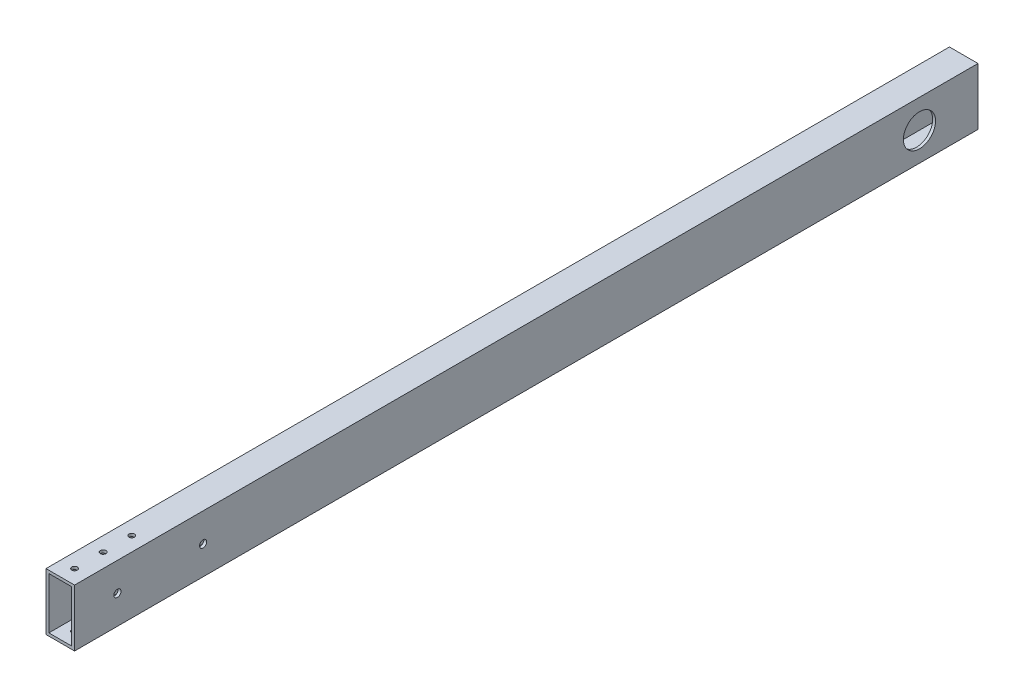
ISO-10303-21;
HEADER;
FILE_DESCRIPTION(('STEP AP214'),'2;1');
FILE_NAME('part.step','',(''),(''),'','','');
FILE_SCHEMA(('AUTOMOTIVE_DESIGN { 1 0 10303 214 1 1 1 1 }'));
ENDSEC;
DATA;
#1=APPLICATION_CONTEXT('core data for automotive mechanical design processes');
#2=APPLICATION_PROTOCOL_DEFINITION('international standard','automotive_design',2000,#1);
#3=PRODUCT_CONTEXT('',#1,'mechanical');
#4=PRODUCT('Part','Part','',(#3));
#5=PRODUCT_RELATED_PRODUCT_CATEGORY('part','',(#4));
#6=PRODUCT_DEFINITION_FORMATION('','',#4);
#7=PRODUCT_DEFINITION_CONTEXT('part definition',#1,'design');
#8=PRODUCT_DEFINITION('design','',#6,#7);
#9=PRODUCT_DEFINITION_SHAPE('','',#8);
#10=(LENGTH_UNIT() NAMED_UNIT(*) SI_UNIT(.MILLI.,.METRE.));
#11=(NAMED_UNIT(*) PLANE_ANGLE_UNIT() SI_UNIT($,.RADIAN.));
#12=(NAMED_UNIT(*) SI_UNIT($,.STERADIAN.) SOLID_ANGLE_UNIT());
#13=UNCERTAINTY_MEASURE_WITH_UNIT(LENGTH_MEASURE(1.E-05),#10,'distance_accuracy_value','');
#14=(GEOMETRIC_REPRESENTATION_CONTEXT(3) GLOBAL_UNCERTAINTY_ASSIGNED_CONTEXT((#13)) GLOBAL_UNIT_ASSIGNED_CONTEXT((#10,
#11,#12)) REPRESENTATION_CONTEXT('',''));
#15=CARTESIAN_POINT('',(0.,0.,0.));
#16=DIRECTION('',(0.,0.,1.));
#17=DIRECTION('',(1.,0.,0.));
#18=AXIS2_PLACEMENT_3D('',#15,#16,#17);
#19=CARTESIAN_POINT('',(0.,0.,401.6375));
#20=DIRECTION('',(0.,0.,1.));
#21=DIRECTION('',(1.,0.,0.));
#22=AXIS2_PLACEMENT_3D('',#19,#20,#21);
#23=PLANE('',#22);
#24=DIRECTION('',(0.,1.,0.));
#25=VECTOR('',#24,1.);
#26=CARTESIAN_POINT('',(12.7,-25.4,401.6375));
#27=LINE('',#26,#25);
#28=CARTESIAN_POINT('',(12.7,-25.4,401.6375));
#29=VERTEX_POINT('',#28);
#30=CARTESIAN_POINT('',(12.7,25.4,401.6375));
#31=VERTEX_POINT('',#30);
#32=EDGE_CURVE('E165',#29,#31,#27,.T.);
#33=ORIENTED_EDGE('',*,*,#32,.T.);
#34=DIRECTION('',(-1.,0.,0.));
#35=VECTOR('',#34,1.);
#36=CARTESIAN_POINT('',(-12.7,25.4,401.6375));
#37=LINE('',#36,#35);
#38=CARTESIAN_POINT('',(-12.7,25.4,401.6375));
#39=VERTEX_POINT('',#38);
#40=EDGE_CURVE('E168',#31,#39,#37,.T.);
#41=ORIENTED_EDGE('',*,*,#40,.T.);
#42=DIRECTION('',(0.,-1.,0.));
#43=VECTOR('',#42,1.);
#44=CARTESIAN_POINT('',(-12.7,-25.4,401.6375));
#45=LINE('',#44,#43);
#46=CARTESIAN_POINT('',(-12.7,-25.4,401.6375));
#47=VERTEX_POINT('',#46);
#48=EDGE_CURVE('E171',#39,#47,#45,.T.);
#49=ORIENTED_EDGE('',*,*,#48,.T.);
#50=DIRECTION('',(1.,0.,0.));
#51=VECTOR('',#50,1.);
#52=CARTESIAN_POINT('',(-12.7,-25.4,401.6375));
#53=LINE('',#52,#51);
#54=EDGE_CURVE('E173',#47,#29,#53,.T.);
#55=ORIENTED_EDGE('',*,*,#54,.T.);
#56=EDGE_LOOP('',(#33,#41,#49,#55));
#57=FACE_BOUND('',#56,.T.);
#58=DIRECTION('',(-1.,0.,0.));
#59=VECTOR('',#58,1.);
#60=CARTESIAN_POINT('',(0.,22.86,401.6375));
#61=LINE('',#60,#59);
#62=CARTESIAN_POINT('',(10.16,22.86,401.6375));
#63=VERTEX_POINT('',#62);
#64=CARTESIAN_POINT('',(-10.16,22.86,401.6375));
#65=VERTEX_POINT('',#64);
#66=EDGE_CURVE('E135',#63,#65,#61,.T.);
#67=ORIENTED_EDGE('',*,*,#66,.F.);
#68=DIRECTION('',(0.,1.,0.));
#69=VECTOR('',#68,1.);
#70=CARTESIAN_POINT('',(10.16,0.,401.6375));
#71=LINE('',#70,#69);
#72=CARTESIAN_POINT('',(10.16,-22.86,401.6375));
#73=VERTEX_POINT('',#72);
#74=EDGE_CURVE('E127',#73,#63,#71,.T.);
#75=ORIENTED_EDGE('',*,*,#74,.F.);
#76=DIRECTION('',(1.,0.,0.));
#77=VECTOR('',#76,1.);
#78=CARTESIAN_POINT('',(0.,-22.86,401.6375));
#79=LINE('',#78,#77);
#80=CARTESIAN_POINT('',(-10.16,-22.86,401.6375));
#81=VERTEX_POINT('',#80);
#82=EDGE_CURVE('E149',#81,#73,#79,.T.);
#83=ORIENTED_EDGE('',*,*,#82,.F.);
#84=DIRECTION('',(0.,-1.,0.));
#85=VECTOR('',#84,1.);
#86=CARTESIAN_POINT('',(-10.16,0.,401.6375));
#87=LINE('',#86,#85);
#88=EDGE_CURVE('E147',#65,#81,#87,.T.);
#89=ORIENTED_EDGE('',*,*,#88,.F.);
#90=EDGE_LOOP('',(#67,#75,#83,#89));
#91=FACE_BOUND('',#90,.T.);
#92=ADVANCED_FACE('F60',(#57,#91),#23,.T.);
#93=CARTESIAN_POINT('',(0.,0.,-401.6375));
#94=DIRECTION('',(0.,0.,1.));
#95=DIRECTION('',(1.,0.,0.));
#96=AXIS2_PLACEMENT_3D('',#93,#94,#95);
#97=PLANE('',#96);
#98=DIRECTION('',(0.,1.,0.));
#99=VECTOR('',#98,1.);
#100=CARTESIAN_POINT('',(12.7,-25.4,-401.6375));
#101=LINE('',#100,#99);
#102=CARTESIAN_POINT('',(12.7,-25.4,-401.6375));
#103=VERTEX_POINT('',#102);
#104=CARTESIAN_POINT('',(12.7,25.4,-401.6375));
#105=VERTEX_POINT('',#104);
#106=EDGE_CURVE('E143',#103,#105,#101,.T.);
#107=ORIENTED_EDGE('',*,*,#106,.F.);
#108=DIRECTION('',(1.,0.,0.));
#109=VECTOR('',#108,1.);
#110=CARTESIAN_POINT('',(-12.7,-25.4,-401.6375));
#111=LINE('',#110,#109);
#112=CARTESIAN_POINT('',(-12.7,-25.4,-401.6375));
#113=VERTEX_POINT('',#112);
#114=EDGE_CURVE('E169',#113,#103,#111,.T.);
#115=ORIENTED_EDGE('',*,*,#114,.F.);
#116=DIRECTION('',(0.,-1.,0.));
#117=VECTOR('',#116,1.);
#118=CARTESIAN_POINT('',(-12.7,-25.4,-401.6375));
#119=LINE('',#118,#117);
#120=CARTESIAN_POINT('',(-12.7,25.4,-401.6375));
#121=VERTEX_POINT('',#120);
#122=EDGE_CURVE('E180',#121,#113,#119,.T.);
#123=ORIENTED_EDGE('',*,*,#122,.F.);
#124=DIRECTION('',(-1.,0.,0.));
#125=VECTOR('',#124,1.);
#126=CARTESIAN_POINT('',(-12.7,25.4,-401.6375));
#127=LINE('',#126,#125);
#128=EDGE_CURVE('E178',#105,#121,#127,.T.);
#129=ORIENTED_EDGE('',*,*,#128,.F.);
#130=EDGE_LOOP('',(#107,#115,#123,#129));
#131=FACE_BOUND('',#130,.T.);
#132=DIRECTION('',(0.,1.,0.));
#133=VECTOR('',#132,1.);
#134=CARTESIAN_POINT('',(10.16,0.,-401.6375));
#135=LINE('',#134,#133);
#136=CARTESIAN_POINT('',(10.16,-22.86,-401.6375));
#137=VERTEX_POINT('',#136);
#138=CARTESIAN_POINT('',(10.16,22.86,-401.6375));
#139=VERTEX_POINT('',#138);
#140=EDGE_CURVE('E85',#137,#139,#135,.T.);
#141=ORIENTED_EDGE('',*,*,#140,.T.);
#142=DIRECTION('',(-1.,0.,0.));
#143=VECTOR('',#142,1.);
#144=CARTESIAN_POINT('',(0.,22.86,-401.6375));
#145=LINE('',#144,#143);
#146=CARTESIAN_POINT('',(-10.16,22.86,-401.6375));
#147=VERTEX_POINT('',#146);
#148=EDGE_CURVE('E142',#139,#147,#145,.T.);
#149=ORIENTED_EDGE('',*,*,#148,.T.);
#150=DIRECTION('',(0.,-1.,0.));
#151=VECTOR('',#150,1.);
#152=CARTESIAN_POINT('',(-10.16,0.,-401.6375));
#153=LINE('',#152,#151);
#154=CARTESIAN_POINT('',(-10.16,-22.86,-401.6375));
#155=VERTEX_POINT('',#154);
#156=EDGE_CURVE('E157',#147,#155,#153,.T.);
#157=ORIENTED_EDGE('',*,*,#156,.T.);
#158=DIRECTION('',(1.,0.,0.));
#159=VECTOR('',#158,1.);
#160=CARTESIAN_POINT('',(0.,-22.86,-401.6375));
#161=LINE('',#160,#159);
#162=EDGE_CURVE('E136',#155,#137,#161,.T.);
#163=ORIENTED_EDGE('',*,*,#162,.T.);
#164=EDGE_LOOP('',(#141,#149,#157,#163));
#165=FACE_BOUND('',#164,.T.);
#166=ADVANCED_FACE('F307',(#131,#165),#97,.F.);
#167=CARTESIAN_POINT('',(12.7,-25.4,401.6375));
#168=DIRECTION('',(-1.,0.,0.));
#169=DIRECTION('',(0.,0.,1.));
#170=AXIS2_PLACEMENT_3D('',#167,#168,#169);
#171=PLANE('',#170);
#172=CARTESIAN_POINT('',(12.7,0.,363.5375));
#173=DIRECTION('',(-1.,0.,0.));
#174=DIRECTION('',(0.,0.,1.));
#175=AXIS2_PLACEMENT_3D('',#172,#173,#174);
#176=CIRCLE('',#175,3.17499999999997);
#177=CARTESIAN_POINT('',(12.7,0.,366.7125));
#178=VERTEX_POINT('',#177);
#179=EDGE_CURVE('E198',#178,#178,#176,.T.);
#180=ORIENTED_EDGE('',*,*,#179,.T.);
#181=EDGE_LOOP('',(#180));
#182=FACE_BOUND('',#181,.T.);
#183=CARTESIAN_POINT('',(12.7,0.,287.3375));
#184=DIRECTION('',(-1.,0.,0.));
#185=DIRECTION('',(0.,0.,1.));
#186=AXIS2_PLACEMENT_3D('',#183,#184,#185);
#187=CIRCLE('',#186,3.17499999999997);
#188=CARTESIAN_POINT('',(12.7,0.,290.5125));
#189=VERTEX_POINT('',#188);
#190=EDGE_CURVE('E270',#189,#189,#187,.T.);
#191=ORIENTED_EDGE('',*,*,#190,.T.);
#192=EDGE_LOOP('',(#191));
#193=FACE_BOUND('',#192,.T.);
#194=CARTESIAN_POINT('',(12.7,0.,-349.594816949944));
#195=DIRECTION('',(-1.,0.,0.));
#196=DIRECTION('',(0.,0.,1.));
#197=AXIS2_PLACEMENT_3D('',#194,#195,#196);
#198=CIRCLE('',#197,14.2875);
#199=CARTESIAN_POINT('',(12.7,0.,-335.307316949944));
#200=VERTEX_POINT('',#199);
#201=EDGE_CURVE('E193',#200,#200,#198,.T.);
#202=ORIENTED_EDGE('',*,*,#201,.T.);
#203=EDGE_LOOP('',(#202));
#204=FACE_BOUND('',#203,.T.);
#205=ORIENTED_EDGE('',*,*,#106,.T.);
#206=DIRECTION('',(0.,0.,-1.));
#207=VECTOR('',#206,1.);
#208=CARTESIAN_POINT('',(12.7,25.4,401.6375));
#209=LINE('',#208,#207);
#210=EDGE_CURVE('E12',#31,#105,#209,.T.);
#211=ORIENTED_EDGE('',*,*,#210,.F.);
#212=ORIENTED_EDGE('',*,*,#32,.F.);
#213=DIRECTION('',(0.,0.,-1.));
#214=VECTOR('',#213,1.);
#215=CARTESIAN_POINT('',(12.7,-25.4,401.6375));
#216=LINE('',#215,#214);
#217=EDGE_CURVE('E175',#29,#103,#216,.T.);
#218=ORIENTED_EDGE('',*,*,#217,.T.);
#219=EDGE_LOOP('',(#205,#211,#212,#218));
#220=FACE_BOUND('',#219,.T.);
#221=ADVANCED_FACE('F62',(#182,#193,#204,#220),#171,.F.);
#222=CARTESIAN_POINT('',(-12.7,25.4,401.6375));
#223=DIRECTION('',(0.,-1.,0.));
#224=DIRECTION('',(0.,0.,-1.));
#225=AXIS2_PLACEMENT_3D('',#222,#223,#224);
#226=PLANE('',#225);
#227=CARTESIAN_POINT('',(0.,25.4,338.1375));
#228=DIRECTION('',(0.,1.,0.));
#229=DIRECTION('',(0.,0.,1.));
#230=AXIS2_PLACEMENT_3D('',#227,#228,#229);
#231=CIRCLE('',#230,2.47650000000006);
#232=CARTESIAN_POINT('',(0.,25.4,340.614));
#233=VERTEX_POINT('',#232);
#234=EDGE_CURVE('E240',#233,#233,#231,.T.);
#235=ORIENTED_EDGE('',*,*,#234,.F.);
#236=EDGE_LOOP('',(#235));
#237=FACE_BOUND('',#236,.T.);
#238=CARTESIAN_POINT('',(0.,25.4,363.5375));
#239=DIRECTION('',(0.,1.,0.));
#240=DIRECTION('',(0.,0.,1.));
#241=AXIS2_PLACEMENT_3D('',#238,#239,#240);
#242=CIRCLE('',#241,2.4765);
#243=CARTESIAN_POINT('',(0.,25.4,366.014));
#244=VERTEX_POINT('',#243);
#245=EDGE_CURVE('E246',#244,#244,#242,.T.);
#246=ORIENTED_EDGE('',*,*,#245,.F.);
#247=EDGE_LOOP('',(#246));
#248=FACE_BOUND('',#247,.T.);
#249=CARTESIAN_POINT('',(0.,25.4,388.9375));
#250=DIRECTION('',(0.,1.,0.));
#251=DIRECTION('',(0.,0.,1.));
#252=AXIS2_PLACEMENT_3D('',#249,#250,#251);
#253=CIRCLE('',#252,2.47649999999997);
#254=CARTESIAN_POINT('',(0.,25.4,391.414));
#255=VERTEX_POINT('',#254);
#256=EDGE_CURVE('E229',#255,#255,#253,.T.);
#257=ORIENTED_EDGE('',*,*,#256,.F.);
#258=EDGE_LOOP('',(#257));
#259=FACE_BOUND('',#258,.T.);
#260=ORIENTED_EDGE('',*,*,#128,.T.);
#261=DIRECTION('',(0.,0.,-1.));
#262=VECTOR('',#261,1.);
#263=CARTESIAN_POINT('',(-12.7,25.4,401.6375));
#264=LINE('',#263,#262);
#265=EDGE_CURVE('E69',#39,#121,#264,.T.);
#266=ORIENTED_EDGE('',*,*,#265,.F.);
#267=ORIENTED_EDGE('',*,*,#40,.F.);
#268=ORIENTED_EDGE('',*,*,#210,.T.);
#269=EDGE_LOOP('',(#260,#266,#267,#268));
#270=FACE_BOUND('',#269,.T.);
#271=ADVANCED_FACE('F316',(#237,#248,#259,#270),#226,.F.);
#272=CARTESIAN_POINT('',(-12.7,-25.4,401.6375));
#273=DIRECTION('',(1.,0.,0.));
#274=DIRECTION('',(0.,0.,-1.));
#275=AXIS2_PLACEMENT_3D('',#272,#273,#274);
#276=PLANE('',#275);
#277=CARTESIAN_POINT('',(-12.7,0.,363.5375));
#278=DIRECTION('',(-1.,0.,0.));
#279=DIRECTION('',(0.,0.,1.));
#280=AXIS2_PLACEMENT_3D('',#277,#278,#279);
#281=CIRCLE('',#280,3.17499999999997);
#282=CARTESIAN_POINT('',(-12.7,0.,366.7125));
#283=VERTEX_POINT('',#282);
#284=EDGE_CURVE('E267',#283,#283,#281,.T.);
#285=ORIENTED_EDGE('',*,*,#284,.F.);
#286=EDGE_LOOP('',(#285));
#287=FACE_BOUND('',#286,.T.);
#288=CARTESIAN_POINT('',(-12.7,0.,287.3375));
#289=DIRECTION('',(-1.,0.,0.));
#290=DIRECTION('',(0.,0.,1.));
#291=AXIS2_PLACEMENT_3D('',#288,#289,#290);
#292=CIRCLE('',#291,3.17499999999997);
#293=CARTESIAN_POINT('',(-12.7,0.,290.5125));
#294=VERTEX_POINT('',#293);
#295=EDGE_CURVE('E210',#294,#294,#292,.T.);
#296=ORIENTED_EDGE('',*,*,#295,.F.);
#297=EDGE_LOOP('',(#296));
#298=FACE_BOUND('',#297,.T.);
#299=CARTESIAN_POINT('',(-12.7,0.,-349.594816949944));
#300=DIRECTION('',(-1.,0.,0.));
#301=DIRECTION('',(0.,0.,1.));
#302=AXIS2_PLACEMENT_3D('',#299,#300,#301);
#303=CIRCLE('',#302,14.2875);
#304=CARTESIAN_POINT('',(-12.7,0.,-335.307316949944));
#305=VERTEX_POINT('',#304);
#306=EDGE_CURVE('E279',#305,#305,#303,.T.);
#307=ORIENTED_EDGE('',*,*,#306,.F.);
#308=EDGE_LOOP('',(#307));
#309=FACE_BOUND('',#308,.T.);
#310=ORIENTED_EDGE('',*,*,#122,.T.);
#311=DIRECTION('',(0.,0.,-1.));
#312=VECTOR('',#311,1.);
#313=CARTESIAN_POINT('',(-12.7,-25.4,401.6375));
#314=LINE('',#313,#312);
#315=EDGE_CURVE('E185',#47,#113,#314,.T.);
#316=ORIENTED_EDGE('',*,*,#315,.F.);
#317=ORIENTED_EDGE('',*,*,#48,.F.);
#318=ORIENTED_EDGE('',*,*,#265,.T.);
#319=EDGE_LOOP('',(#310,#316,#317,#318));
#320=FACE_BOUND('',#319,.T.);
#321=ADVANCED_FACE('F300',(#287,#298,#309,#320),#276,.F.);
#322=CARTESIAN_POINT('',(-12.7,-25.4,401.6375));
#323=DIRECTION('',(0.,1.,0.));
#324=DIRECTION('',(0.,0.,1.));
#325=AXIS2_PLACEMENT_3D('',#322,#323,#324);
#326=PLANE('',#325);
#327=CARTESIAN_POINT('',(-5.00130603698018,-25.4,-196.811900000001));
#328=DIRECTION('',(0.,-1.,0.));
#329=DIRECTION('',(0.,0.,-1.));
#330=AXIS2_PLACEMENT_3D('',#327,#328,#329);
#331=CIRCLE('',#330,2.47650423254111);
#332=CARTESIAN_POINT('',(-5.00130603698018,-25.4,-199.288404232542));
#333=VERTEX_POINT('',#332);
#334=EDGE_CURVE('E225',#333,#333,#331,.T.);
#335=ORIENTED_EDGE('',*,*,#334,.F.);
#336=EDGE_LOOP('',(#335));
#337=FACE_BOUND('',#336,.T.);
#338=CARTESIAN_POINT('',(-5.04826627900002,-25.4,-184.111986821431));
#339=DIRECTION('',(0.,-1.,0.));
#340=DIRECTION('',(0.,0.,-1.));
#341=AXIS2_PLACEMENT_3D('',#338,#339,#340);
#342=CIRCLE('',#341,2.47650423254111);
#343=CARTESIAN_POINT('',(-5.04826627900002,-25.4,-186.588491053972));
#344=VERTEX_POINT('',#343);
#345=EDGE_CURVE('E231',#344,#344,#342,.T.);
#346=ORIENTED_EDGE('',*,*,#345,.F.);
#347=EDGE_LOOP('',(#346));
#348=FACE_BOUND('',#347,.T.);
#349=CARTESIAN_POINT('',(0.,-25.4,338.1375));
#350=DIRECTION('',(0.,1.,0.));
#351=DIRECTION('',(0.,0.,1.));
#352=AXIS2_PLACEMENT_3D('',#349,#350,#351);
#353=CIRCLE('',#352,2.47650000000006);
#354=CARTESIAN_POINT('',(0.,-25.4,340.614));
#355=VERTEX_POINT('',#354);
#356=EDGE_CURVE('E215',#355,#355,#353,.T.);
#357=ORIENTED_EDGE('',*,*,#356,.T.);
#358=EDGE_LOOP('',(#357));
#359=FACE_BOUND('',#358,.T.);
#360=CARTESIAN_POINT('',(0.,-25.4,363.5375));
#361=DIRECTION('',(0.,1.,0.));
#362=DIRECTION('',(0.,0.,1.));
#363=AXIS2_PLACEMENT_3D('',#360,#361,#362);
#364=CIRCLE('',#363,2.4765);
#365=CARTESIAN_POINT('',(0.,-25.4,366.014));
#366=VERTEX_POINT('',#365);
#367=EDGE_CURVE('E243',#366,#366,#364,.T.);
#368=ORIENTED_EDGE('',*,*,#367,.T.);
#369=EDGE_LOOP('',(#368));
#370=FACE_BOUND('',#369,.T.);
#371=CARTESIAN_POINT('',(0.,-25.4,388.9375));
#372=DIRECTION('',(0.,1.,0.));
#373=DIRECTION('',(0.,0.,1.));
#374=AXIS2_PLACEMENT_3D('',#371,#372,#373);
#375=CIRCLE('',#374,2.47649999999997);
#376=CARTESIAN_POINT('',(0.,-25.4,391.414));
#377=VERTEX_POINT('',#376);
#378=EDGE_CURVE('E249',#377,#377,#375,.T.);
#379=ORIENTED_EDGE('',*,*,#378,.T.);
#380=EDGE_LOOP('',(#379));
#381=FACE_BOUND('',#380,.T.);
#382=CARTESIAN_POINT('',(-5.10954657230445E-06,-25.4,228.865824925079));
#383=DIRECTION('',(0.,-1.,0.));
#384=DIRECTION('',(0.,0.,-1.));
#385=AXIS2_PLACEMENT_3D('',#382,#383,#384);
#386=CIRCLE('',#385,2.47650000000002);
#387=CARTESIAN_POINT('',(-5.10954657230445E-06,-25.4,226.389324925079));
#388=VERTEX_POINT('',#387);
#389=EDGE_CURVE('E207',#388,#388,#386,.T.);
#390=ORIENTED_EDGE('',*,*,#389,.F.);
#391=EDGE_LOOP('',(#390));
#392=FACE_BOUND('',#391,.T.);
#393=CARTESIAN_POINT('',(2.1163626406917E-13,-25.4,152.665824925079));
#394=DIRECTION('',(0.,-1.,0.));
#395=DIRECTION('',(0.,0.,-1.));
#396=AXIS2_PLACEMENT_3D('',#393,#394,#395);
#397=CIRCLE('',#396,2.47650000000001);
#398=CARTESIAN_POINT('',(2.1163626406917E-13,-25.4,150.189324925079));
#399=VERTEX_POINT('',#398);
#400=EDGE_CURVE('E260',#399,#399,#397,.T.);
#401=ORIENTED_EDGE('',*,*,#400,.F.);
#402=EDGE_LOOP('',(#401));
#403=FACE_BOUND('',#402,.T.);
#404=ORIENTED_EDGE('',*,*,#114,.T.);
#405=ORIENTED_EDGE('',*,*,#217,.F.);
#406=ORIENTED_EDGE('',*,*,#54,.F.);
#407=ORIENTED_EDGE('',*,*,#315,.T.);
#408=EDGE_LOOP('',(#404,#405,#406,#407));
#409=FACE_BOUND('',#408,.T.);
#410=ADVANCED_FACE('F290',(#337,#348,#359,#370,#381,#392,#403,#409),#326,.F.);
#411=CARTESIAN_POINT('',(10.16,0.,401.6375));
#412=DIRECTION('',(-1.,0.,0.));
#413=DIRECTION('',(0.,0.,1.));
#414=AXIS2_PLACEMENT_3D('',#411,#412,#413);
#415=PLANE('',#414);
#416=CARTESIAN_POINT('',(10.16,0.,363.5375));
#417=DIRECTION('',(-1.,0.,0.));
#418=DIRECTION('',(0.,0.,1.));
#419=AXIS2_PLACEMENT_3D('',#416,#417,#418);
#420=CIRCLE('',#419,3.17499999999997);
#421=CARTESIAN_POINT('',(10.16,0.,366.7125));
#422=VERTEX_POINT('',#421);
#423=EDGE_CURVE('E202',#422,#422,#420,.T.);
#424=ORIENTED_EDGE('',*,*,#423,.F.);
#425=EDGE_LOOP('',(#424));
#426=FACE_BOUND('',#425,.T.);
#427=CARTESIAN_POINT('',(10.16,0.,287.3375));
#428=DIRECTION('',(-1.,0.,0.));
#429=DIRECTION('',(0.,0.,1.));
#430=AXIS2_PLACEMENT_3D('',#427,#428,#429);
#431=CIRCLE('',#430,3.17499999999997);
#432=CARTESIAN_POINT('',(10.16,0.,290.5125));
#433=VERTEX_POINT('',#432);
#434=EDGE_CURVE('E197',#433,#433,#431,.T.);
#435=ORIENTED_EDGE('',*,*,#434,.F.);
#436=EDGE_LOOP('',(#435));
#437=FACE_BOUND('',#436,.T.);
#438=CARTESIAN_POINT('',(10.16,0.,-349.594816949944));
#439=DIRECTION('',(-1.,0.,0.));
#440=DIRECTION('',(0.,0.,1.));
#441=AXIS2_PLACEMENT_3D('',#438,#439,#440);
#442=CIRCLE('',#441,14.2875);
#443=CARTESIAN_POINT('',(10.16,0.,-335.307316949944));
#444=VERTEX_POINT('',#443);
#445=EDGE_CURVE('E155',#444,#444,#442,.T.);
#446=ORIENTED_EDGE('',*,*,#445,.F.);
#447=EDGE_LOOP('',(#446));
#448=FACE_BOUND('',#447,.T.);
#449=ORIENTED_EDGE('',*,*,#140,.F.);
#450=DIRECTION('',(0.,0.,-1.));
#451=VECTOR('',#450,1.);
#452=CARTESIAN_POINT('',(10.16,-22.86,401.6375));
#453=LINE('',#452,#451);
#454=EDGE_CURVE('E131',#73,#137,#453,.T.);
#455=ORIENTED_EDGE('',*,*,#454,.F.);
#456=ORIENTED_EDGE('',*,*,#74,.T.);
#457=DIRECTION('',(0.,0.,-1.));
#458=VECTOR('',#457,1.);
#459=CARTESIAN_POINT('',(10.16,22.86,401.6375));
#460=LINE('',#459,#458);
#461=EDGE_CURVE('E130',#63,#139,#460,.T.);
#462=ORIENTED_EDGE('',*,*,#461,.T.);
#463=EDGE_LOOP('',(#449,#455,#456,#462));
#464=FACE_BOUND('',#463,.T.);
#465=ADVANCED_FACE('F129',(#426,#437,#448,#464),#415,.T.);
#466=CARTESIAN_POINT('',(0.,22.86,401.6375));
#467=DIRECTION('',(0.,-1.,0.));
#468=DIRECTION('',(0.,0.,-1.));
#469=AXIS2_PLACEMENT_3D('',#466,#467,#468);
#470=PLANE('',#469);
#471=CARTESIAN_POINT('',(0.,22.86,338.1375));
#472=DIRECTION('',(0.,-1.,0.));
#473=DIRECTION('',(0.,0.,-1.));
#474=AXIS2_PLACEMENT_3D('',#471,#472,#473);
#475=CIRCLE('',#474,2.47650000000006);
#476=CARTESIAN_POINT('',(0.,22.86,335.661));
#477=VERTEX_POINT('',#476);
#478=EDGE_CURVE('E222',#477,#477,#475,.T.);
#479=ORIENTED_EDGE('',*,*,#478,.F.);
#480=EDGE_LOOP('',(#479));
#481=FACE_BOUND('',#480,.T.);
#482=CARTESIAN_POINT('',(0.,22.86,363.5375));
#483=DIRECTION('',(0.,-1.,0.));
#484=DIRECTION('',(0.,0.,-1.));
#485=AXIS2_PLACEMENT_3D('',#482,#483,#484);
#486=CIRCLE('',#485,2.4765);
#487=CARTESIAN_POINT('',(0.,22.86,361.061));
#488=VERTEX_POINT('',#487);
#489=EDGE_CURVE('E219',#488,#488,#486,.T.);
#490=ORIENTED_EDGE('',*,*,#489,.F.);
#491=EDGE_LOOP('',(#490));
#492=FACE_BOUND('',#491,.T.);
#493=CARTESIAN_POINT('',(0.,22.86,388.9375));
#494=DIRECTION('',(0.,-1.,0.));
#495=DIRECTION('',(0.,0.,-1.));
#496=AXIS2_PLACEMENT_3D('',#493,#494,#495);
#497=CIRCLE('',#496,2.47649999999997);
#498=CARTESIAN_POINT('',(0.,22.86,386.461));
#499=VERTEX_POINT('',#498);
#500=EDGE_CURVE('E214',#499,#499,#497,.T.);
#501=ORIENTED_EDGE('',*,*,#500,.F.);
#502=EDGE_LOOP('',(#501));
#503=FACE_BOUND('',#502,.T.);
#504=ORIENTED_EDGE('',*,*,#148,.F.);
#505=ORIENTED_EDGE('',*,*,#461,.F.);
#506=ORIENTED_EDGE('',*,*,#66,.T.);
#507=DIRECTION('',(0.,0.,-1.));
#508=VECTOR('',#507,1.);
#509=CARTESIAN_POINT('',(-10.16,22.86,401.6375));
#510=LINE('',#509,#508);
#511=EDGE_CURVE('E144',#65,#147,#510,.T.);
#512=ORIENTED_EDGE('',*,*,#511,.T.);
#513=EDGE_LOOP('',(#504,#505,#506,#512));
#514=FACE_BOUND('',#513,.T.);
#515=ADVANCED_FACE('F139',(#481,#492,#503,#514),#470,.T.);
#516=CARTESIAN_POINT('',(-10.16,0.,401.6375));
#517=DIRECTION('',(1.,0.,0.));
#518=DIRECTION('',(0.,0.,-1.));
#519=AXIS2_PLACEMENT_3D('',#516,#517,#518);
#520=PLANE('',#519);
#521=CARTESIAN_POINT('',(-10.16,0.,363.5375));
#522=DIRECTION('',(1.,0.,0.));
#523=DIRECTION('',(0.,0.,-1.));
#524=AXIS2_PLACEMENT_3D('',#521,#522,#523);
#525=CIRCLE('',#524,3.17499999999997);
#526=CARTESIAN_POINT('',(-10.16,0.,360.3625));
#527=VERTEX_POINT('',#526);
#528=EDGE_CURVE('E199',#527,#527,#525,.T.);
#529=ORIENTED_EDGE('',*,*,#528,.F.);
#530=EDGE_LOOP('',(#529));
#531=FACE_BOUND('',#530,.T.);
#532=CARTESIAN_POINT('',(-10.16,0.,287.3375));
#533=DIRECTION('',(1.,0.,0.));
#534=DIRECTION('',(0.,0.,-1.));
#535=AXIS2_PLACEMENT_3D('',#532,#533,#534);
#536=CIRCLE('',#535,3.17499999999997);
#537=CARTESIAN_POINT('',(-10.16,0.,284.1625));
#538=VERTEX_POINT('',#537);
#539=EDGE_CURVE('E194',#538,#538,#536,.T.);
#540=ORIENTED_EDGE('',*,*,#539,.F.);
#541=EDGE_LOOP('',(#540));
#542=FACE_BOUND('',#541,.T.);
#543=CARTESIAN_POINT('',(-10.16,0.,-349.594816949944));
#544=DIRECTION('',(1.,0.,0.));
#545=DIRECTION('',(0.,0.,-1.));
#546=AXIS2_PLACEMENT_3D('',#543,#544,#545);
#547=CIRCLE('',#546,14.2875);
#548=CARTESIAN_POINT('',(-10.16,0.,-363.882316949944));
#549=VERTEX_POINT('',#548);
#550=EDGE_CURVE('E190',#549,#549,#547,.T.);
#551=ORIENTED_EDGE('',*,*,#550,.F.);
#552=EDGE_LOOP('',(#551));
#553=FACE_BOUND('',#552,.T.);
#554=ORIENTED_EDGE('',*,*,#156,.F.);
#555=ORIENTED_EDGE('',*,*,#511,.F.);
#556=ORIENTED_EDGE('',*,*,#88,.T.);
#557=DIRECTION('',(0.,0.,-1.));
#558=VECTOR('',#557,1.);
#559=CARTESIAN_POINT('',(-10.16,-22.86,401.6375));
#560=LINE('',#559,#558);
#561=EDGE_CURVE('E77',#81,#155,#560,.T.);
#562=ORIENTED_EDGE('',*,*,#561,.T.);
#563=EDGE_LOOP('',(#554,#555,#556,#562));
#564=FACE_BOUND('',#563,.T.);
#565=ADVANCED_FACE('F297',(#531,#542,#553,#564),#520,.T.);
#566=CARTESIAN_POINT('',(0.,-22.86,401.6375));
#567=DIRECTION('',(0.,1.,0.));
#568=DIRECTION('',(0.,0.,1.));
#569=AXIS2_PLACEMENT_3D('',#566,#567,#568);
#570=PLANE('',#569);
#571=CARTESIAN_POINT('',(-5.00130603698018,-22.86,-196.811900000001));
#572=DIRECTION('',(0.,1.,0.));
#573=DIRECTION('',(0.,0.,1.));
#574=AXIS2_PLACEMENT_3D('',#571,#572,#573);
#575=CIRCLE('',#574,2.47650423254111);
#576=CARTESIAN_POINT('',(-5.00130603698018,-22.86,-194.33539576746));
#577=VERTEX_POINT('',#576);
#578=EDGE_CURVE('E64',#577,#577,#575,.T.);
#579=ORIENTED_EDGE('',*,*,#578,.F.);
#580=EDGE_LOOP('',(#579));
#581=FACE_BOUND('',#580,.T.);
#582=CARTESIAN_POINT('',(-5.04826627900002,-22.86,-184.111986821431));
#583=DIRECTION('',(0.,1.,0.));
#584=DIRECTION('',(0.,0.,1.));
#585=AXIS2_PLACEMENT_3D('',#582,#583,#584);
#586=CIRCLE('',#585,2.47650423254111);
#587=CARTESIAN_POINT('',(-5.04826627900002,-22.86,-181.63548258889));
#588=VERTEX_POINT('',#587);
#589=EDGE_CURVE('E223',#588,#588,#586,.T.);
#590=ORIENTED_EDGE('',*,*,#589,.F.);
#591=EDGE_LOOP('',(#590));
#592=FACE_BOUND('',#591,.T.);
#593=CARTESIAN_POINT('',(0.,-22.86,338.1375));
#594=DIRECTION('',(0.,1.,0.));
#595=DIRECTION('',(0.,0.,1.));
#596=AXIS2_PLACEMENT_3D('',#593,#594,#595);
#597=CIRCLE('',#596,2.47650000000006);
#598=CARTESIAN_POINT('',(0.,-22.86,340.614));
#599=VERTEX_POINT('',#598);
#600=EDGE_CURVE('E220',#599,#599,#597,.T.);
#601=ORIENTED_EDGE('',*,*,#600,.F.);
#602=EDGE_LOOP('',(#601));
#603=FACE_BOUND('',#602,.T.);
#604=CARTESIAN_POINT('',(0.,-22.86,363.5375));
#605=DIRECTION('',(0.,1.,0.));
#606=DIRECTION('',(0.,0.,1.));
#607=AXIS2_PLACEMENT_3D('',#604,#605,#606);
#608=CIRCLE('',#607,2.4765);
#609=CARTESIAN_POINT('',(0.,-22.86,366.014));
#610=VERTEX_POINT('',#609);
#611=EDGE_CURVE('E216',#610,#610,#608,.T.);
#612=ORIENTED_EDGE('',*,*,#611,.F.);
#613=EDGE_LOOP('',(#612));
#614=FACE_BOUND('',#613,.T.);
#615=CARTESIAN_POINT('',(0.,-22.86,388.9375));
#616=DIRECTION('',(0.,1.,0.));
#617=DIRECTION('',(0.,0.,1.));
#618=AXIS2_PLACEMENT_3D('',#615,#616,#617);
#619=CIRCLE('',#618,2.47649999999997);
#620=CARTESIAN_POINT('',(0.,-22.86,391.414));
#621=VERTEX_POINT('',#620);
#622=EDGE_CURVE('E211',#621,#621,#619,.T.);
#623=ORIENTED_EDGE('',*,*,#622,.F.);
#624=EDGE_LOOP('',(#623));
#625=FACE_BOUND('',#624,.T.);
#626=CARTESIAN_POINT('',(-5.10954657230445E-06,-22.86,228.865824925079));
#627=DIRECTION('',(0.,1.,0.));
#628=DIRECTION('',(0.,0.,1.));
#629=AXIS2_PLACEMENT_3D('',#626,#627,#628);
#630=CIRCLE('',#629,2.47650000000002);
#631=CARTESIAN_POINT('',(-5.10954657230445E-06,-22.86,231.342324925079));
#632=VERTEX_POINT('',#631);
#633=EDGE_CURVE('E206',#632,#632,#630,.T.);
#634=ORIENTED_EDGE('',*,*,#633,.F.);
#635=EDGE_LOOP('',(#634));
#636=FACE_BOUND('',#635,.T.);
#637=CARTESIAN_POINT('',(2.1163626406917E-13,-22.86,152.665824925079));
#638=DIRECTION('',(0.,1.,0.));
#639=DIRECTION('',(0.,0.,1.));
#640=AXIS2_PLACEMENT_3D('',#637,#638,#639);
#641=CIRCLE('',#640,2.47650000000001);
#642=CARTESIAN_POINT('',(2.1163626406917E-13,-22.86,155.142324925079));
#643=VERTEX_POINT('',#642);
#644=EDGE_CURVE('E203',#643,#643,#641,.T.);
#645=ORIENTED_EDGE('',*,*,#644,.F.);
#646=EDGE_LOOP('',(#645));
#647=FACE_BOUND('',#646,.T.);
#648=ORIENTED_EDGE('',*,*,#162,.F.);
#649=ORIENTED_EDGE('',*,*,#561,.F.);
#650=ORIENTED_EDGE('',*,*,#82,.T.);
#651=ORIENTED_EDGE('',*,*,#454,.T.);
#652=EDGE_LOOP('',(#648,#649,#650,#651));
#653=FACE_BOUND('',#652,.T.);
#654=ADVANCED_FACE('F345',(#581,#592,#603,#614,#625,#636,#647,#653),#570,.T.);
#655=CARTESIAN_POINT('',(12.7,0.,-349.594816949944));
#656=DIRECTION('',(-1.,0.,0.));
#657=DIRECTION('',(0.,0.,1.));
#658=AXIS2_PLACEMENT_3D('',#655,#656,#657);
#659=CYLINDRICAL_SURFACE('',#658,14.2875);
#660=ORIENTED_EDGE('',*,*,#550,.T.);
#661=EDGE_LOOP('',(#660));
#662=FACE_BOUND('',#661,.T.);
#663=ORIENTED_EDGE('',*,*,#306,.T.);
#664=EDGE_LOOP('',(#663));
#665=FACE_BOUND('',#664,.T.);
#666=ADVANCED_FACE('F347',(#662,#665),#659,.F.);
#667=ORIENTED_EDGE('',*,*,#445,.T.);
#668=EDGE_LOOP('',(#667));
#669=FACE_BOUND('',#668,.T.);
#670=ORIENTED_EDGE('',*,*,#201,.F.);
#671=EDGE_LOOP('',(#670));
#672=FACE_BOUND('',#671,.T.);
#673=ADVANCED_FACE('F286',(#669,#672),#659,.F.);
#674=CARTESIAN_POINT('',(12.7,0.,287.3375));
#675=DIRECTION('',(-1.,0.,0.));
#676=DIRECTION('',(0.,0.,1.));
#677=AXIS2_PLACEMENT_3D('',#674,#675,#676);
#678=CYLINDRICAL_SURFACE('',#677,3.17499999999997);
#679=ORIENTED_EDGE('',*,*,#539,.T.);
#680=EDGE_LOOP('',(#679));
#681=FACE_BOUND('',#680,.T.);
#682=ORIENTED_EDGE('',*,*,#295,.T.);
#683=EDGE_LOOP('',(#682));
#684=FACE_BOUND('',#683,.T.);
#685=ADVANCED_FACE('F361',(#681,#684),#678,.F.);
#686=CARTESIAN_POINT('',(12.7,0.,363.5375));
#687=DIRECTION('',(-1.,0.,0.));
#688=DIRECTION('',(0.,0.,1.));
#689=AXIS2_PLACEMENT_3D('',#686,#687,#688);
#690=CYLINDRICAL_SURFACE('',#689,3.17499999999997);
#691=ORIENTED_EDGE('',*,*,#528,.T.);
#692=EDGE_LOOP('',(#691));
#693=FACE_BOUND('',#692,.T.);
#694=ORIENTED_EDGE('',*,*,#284,.T.);
#695=EDGE_LOOP('',(#694));
#696=FACE_BOUND('',#695,.T.);
#697=ADVANCED_FACE('F364',(#693,#696),#690,.F.);
#698=ORIENTED_EDGE('',*,*,#434,.T.);
#699=EDGE_LOOP('',(#698));
#700=FACE_BOUND('',#699,.T.);
#701=ORIENTED_EDGE('',*,*,#190,.F.);
#702=EDGE_LOOP('',(#701));
#703=FACE_BOUND('',#702,.T.);
#704=ADVANCED_FACE('F366',(#700,#703),#678,.F.);
#705=ORIENTED_EDGE('',*,*,#423,.T.);
#706=EDGE_LOOP('',(#705));
#707=FACE_BOUND('',#706,.T.);
#708=ORIENTED_EDGE('',*,*,#179,.F.);
#709=EDGE_LOOP('',(#708));
#710=FACE_BOUND('',#709,.T.);
#711=ADVANCED_FACE('F370',(#707,#710),#690,.F.);
#712=CARTESIAN_POINT('',(2.1163626406917E-13,-21.59,152.665824925079));
#713=DIRECTION('',(0.,-1.,0.));
#714=DIRECTION('',(0.,0.,-1.));
#715=AXIS2_PLACEMENT_3D('',#712,#713,#714);
#716=CYLINDRICAL_SURFACE('',#715,2.47650000000001);
#717=ORIENTED_EDGE('',*,*,#644,.T.);
#718=EDGE_LOOP('',(#717));
#719=FACE_BOUND('',#718,.T.);
#720=ORIENTED_EDGE('',*,*,#400,.T.);
#721=EDGE_LOOP('',(#720));
#722=FACE_BOUND('',#721,.T.);
#723=ADVANCED_FACE('F371',(#719,#722),#716,.F.);
#724=CARTESIAN_POINT('',(-5.10954657230445E-06,-21.59,228.865824925079));
#725=DIRECTION('',(0.,-1.,0.));
#726=DIRECTION('',(0.,0.,-1.));
#727=AXIS2_PLACEMENT_3D('',#724,#725,#726);
#728=CYLINDRICAL_SURFACE('',#727,2.47650000000002);
#729=ORIENTED_EDGE('',*,*,#633,.T.);
#730=EDGE_LOOP('',(#729));
#731=FACE_BOUND('',#730,.T.);
#732=ORIENTED_EDGE('',*,*,#389,.T.);
#733=EDGE_LOOP('',(#732));
#734=FACE_BOUND('',#733,.T.);
#735=ADVANCED_FACE('F374',(#731,#734),#728,.F.);
#736=CARTESIAN_POINT('',(0.,-25.4,388.9375));
#737=DIRECTION('',(0.,1.,0.));
#738=DIRECTION('',(0.,0.,1.));
#739=AXIS2_PLACEMENT_3D('',#736,#737,#738);
#740=CYLINDRICAL_SURFACE('',#739,2.47649999999997);
#741=ORIENTED_EDGE('',*,*,#622,.T.);
#742=EDGE_LOOP('',(#741));
#743=FACE_BOUND('',#742,.T.);
#744=ORIENTED_EDGE('',*,*,#378,.F.);
#745=EDGE_LOOP('',(#744));
#746=FACE_BOUND('',#745,.T.);
#747=ADVANCED_FACE('F378',(#743,#746),#740,.F.);
#748=CARTESIAN_POINT('',(0.,-25.4,363.5375));
#749=DIRECTION('',(0.,1.,0.));
#750=DIRECTION('',(0.,0.,1.));
#751=AXIS2_PLACEMENT_3D('',#748,#749,#750);
#752=CYLINDRICAL_SURFACE('',#751,2.4765);
#753=ORIENTED_EDGE('',*,*,#611,.T.);
#754=EDGE_LOOP('',(#753));
#755=FACE_BOUND('',#754,.T.);
#756=ORIENTED_EDGE('',*,*,#367,.F.);
#757=EDGE_LOOP('',(#756));
#758=FACE_BOUND('',#757,.T.);
#759=ADVANCED_FACE('F382',(#755,#758),#752,.F.);
#760=CARTESIAN_POINT('',(0.,-25.4,338.1375));
#761=DIRECTION('',(0.,1.,0.));
#762=DIRECTION('',(0.,0.,1.));
#763=AXIS2_PLACEMENT_3D('',#760,#761,#762);
#764=CYLINDRICAL_SURFACE('',#763,2.47650000000006);
#765=ORIENTED_EDGE('',*,*,#600,.T.);
#766=EDGE_LOOP('',(#765));
#767=FACE_BOUND('',#766,.T.);
#768=ORIENTED_EDGE('',*,*,#356,.F.);
#769=EDGE_LOOP('',(#768));
#770=FACE_BOUND('',#769,.T.);
#771=ADVANCED_FACE('F387',(#767,#770),#764,.F.);
#772=ORIENTED_EDGE('',*,*,#500,.T.);
#773=EDGE_LOOP('',(#772));
#774=FACE_BOUND('',#773,.T.);
#775=ORIENTED_EDGE('',*,*,#256,.T.);
#776=EDGE_LOOP('',(#775));
#777=FACE_BOUND('',#776,.T.);
#778=ADVANCED_FACE('F384',(#774,#777),#740,.F.);
#779=ORIENTED_EDGE('',*,*,#489,.T.);
#780=EDGE_LOOP('',(#779));
#781=FACE_BOUND('',#780,.T.);
#782=ORIENTED_EDGE('',*,*,#245,.T.);
#783=EDGE_LOOP('',(#782));
#784=FACE_BOUND('',#783,.T.);
#785=ADVANCED_FACE('F389',(#781,#784),#752,.F.);
#786=ORIENTED_EDGE('',*,*,#478,.T.);
#787=EDGE_LOOP('',(#786));
#788=FACE_BOUND('',#787,.T.);
#789=ORIENTED_EDGE('',*,*,#234,.T.);
#790=EDGE_LOOP('',(#789));
#791=FACE_BOUND('',#790,.T.);
#792=ADVANCED_FACE('F393',(#788,#791),#764,.F.);
#793=CARTESIAN_POINT('',(-5.04826627900002,-21.59,-184.111986821431));
#794=DIRECTION('',(0.,-1.,0.));
#795=DIRECTION('',(0.,0.,-1.));
#796=AXIS2_PLACEMENT_3D('',#793,#794,#795);
#797=CYLINDRICAL_SURFACE('',#796,2.47650423254111);
#798=ORIENTED_EDGE('',*,*,#589,.T.);
#799=EDGE_LOOP('',(#798));
#800=FACE_BOUND('',#799,.T.);
#801=ORIENTED_EDGE('',*,*,#345,.T.);
#802=EDGE_LOOP('',(#801));
#803=FACE_BOUND('',#802,.T.);
#804=ADVANCED_FACE('F394',(#800,#803),#797,.F.);
#805=CARTESIAN_POINT('',(-5.00130603698018,-21.59,-196.811900000001));
#806=DIRECTION('',(0.,-1.,0.));
#807=DIRECTION('',(0.,0.,-1.));
#808=AXIS2_PLACEMENT_3D('',#805,#806,#807);
#809=CYLINDRICAL_SURFACE('',#808,2.47650423254111);
#810=ORIENTED_EDGE('',*,*,#578,.T.);
#811=EDGE_LOOP('',(#810));
#812=FACE_BOUND('',#811,.T.);
#813=ORIENTED_EDGE('',*,*,#334,.T.);
#814=EDGE_LOOP('',(#813));
#815=FACE_BOUND('',#814,.T.);
#816=ADVANCED_FACE('F397',(#812,#815),#809,.F.);
#817=CLOSED_SHELL('',(#92,#166,#221,#271,#321,#410,#465,#515,#565,#654,#666,#673,#685,#697,#704,
#711,#723,#735,#747,#759,#771,#778,#785,#792,#804,#816));
#818=MANIFOLD_SOLID_BREP('B2',#817);
#819=ADVANCED_BREP_SHAPE_REPRESENTATION('',(#18,#818),#14);
#820=SHAPE_DEFINITION_REPRESENTATION(#9,#819);
ENDSEC;
END-ISO-10303-21;
